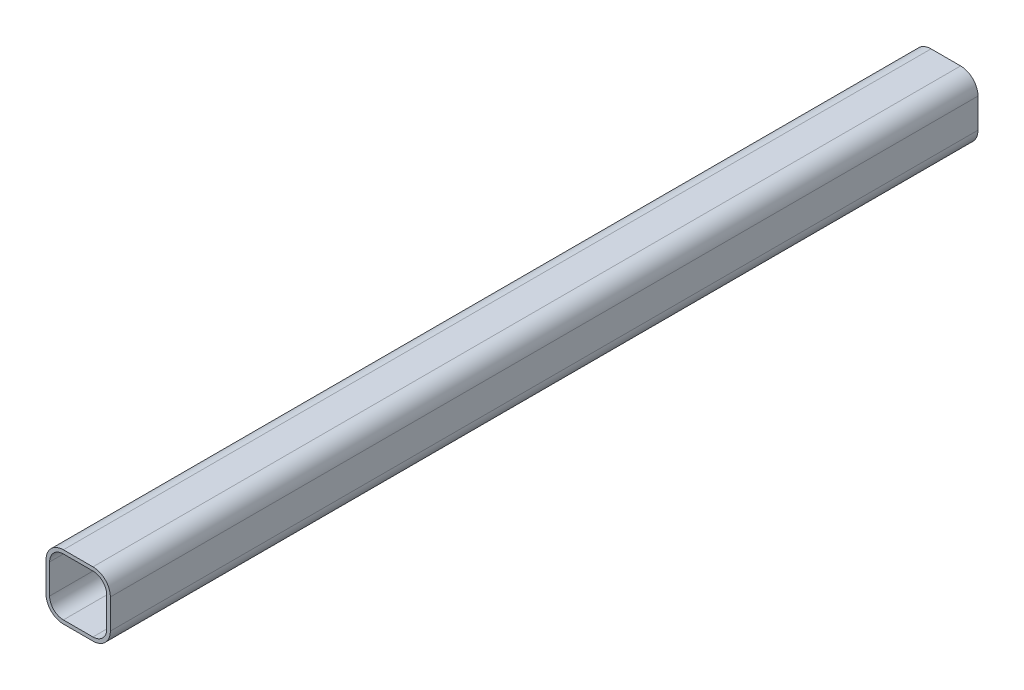
ISO-10303-21;
HEADER;
FILE_DESCRIPTION(('STEP AP214'),'2;1');
FILE_NAME('part.step','',(''),(''),'','','');
FILE_SCHEMA(('AUTOMOTIVE_DESIGN { 1 0 10303 214 1 1 1 1 }'));
ENDSEC;
DATA;
#1=APPLICATION_CONTEXT('core data for automotive mechanical design processes');
#2=APPLICATION_PROTOCOL_DEFINITION('international standard','automotive_design',2000,#1);
#3=PRODUCT_CONTEXT('',#1,'mechanical');
#4=PRODUCT('Part','Part','',(#3));
#5=PRODUCT_RELATED_PRODUCT_CATEGORY('part','',(#4));
#6=PRODUCT_DEFINITION_FORMATION('','',#4);
#7=PRODUCT_DEFINITION_CONTEXT('part definition',#1,'design');
#8=PRODUCT_DEFINITION('design','',#6,#7);
#9=PRODUCT_DEFINITION_SHAPE('','',#8);
#10=(LENGTH_UNIT() NAMED_UNIT(*) SI_UNIT(.MILLI.,.METRE.));
#11=(NAMED_UNIT(*) PLANE_ANGLE_UNIT() SI_UNIT($,.RADIAN.));
#12=(NAMED_UNIT(*) SI_UNIT($,.STERADIAN.) SOLID_ANGLE_UNIT());
#13=UNCERTAINTY_MEASURE_WITH_UNIT(LENGTH_MEASURE(1.E-05),#10,'distance_accuracy_value','');
#14=(GEOMETRIC_REPRESENTATION_CONTEXT(3) GLOBAL_UNCERTAINTY_ASSIGNED_CONTEXT((#13)) GLOBAL_UNIT_ASSIGNED_CONTEXT((#10,
#11,#12)) REPRESENTATION_CONTEXT('',''));
#15=CARTESIAN_POINT('',(0.,0.,0.));
#16=DIRECTION('',(0.,0.,1.));
#17=DIRECTION('',(1.,0.,0.));
#18=AXIS2_PLACEMENT_3D('',#15,#16,#17);
#19=CARTESIAN_POINT('',(-11.303,-11.303,-152.4));
#20=DIRECTION('',(0.,0.,1.));
#21=DIRECTION('',(1.,0.,0.));
#22=AXIS2_PLACEMENT_3D('',#19,#20,#21);
#23=PLANE('',#22);
#24=DIRECTION('',(0.,1.,0.));
#25=VECTOR('',#24,1.);
#26=CARTESIAN_POINT('',(-10.033,0.,-152.4));
#27=LINE('',#26,#25);
#28=CARTESIAN_POINT('',(-10.033,-5.19112500043521,-152.4));
#29=VERTEX_POINT('',#28);
#30=CARTESIAN_POINT('',(-10.033,5.19112499999956,-152.4));
#31=VERTEX_POINT('',#30);
#32=EDGE_CURVE('E158',#29,#31,#27,.T.);
#33=ORIENTED_EDGE('',*,*,#32,.F.);
#34=CARTESIAN_POINT('',(-5.191125,-5.19112500000087,-152.4));
#35=DIRECTION('',(0.,0.,-1.));
#36=DIRECTION('',(0.,1.,0.));
#37=AXIS2_PLACEMENT_3D('',#34,#35,#36);
#38=CIRCLE('',#37,4.841875);
#39=CARTESIAN_POINT('',(-5.19112499906869,-10.033,-152.4));
#40=VERTEX_POINT('',#39);
#41=EDGE_CURVE('E209',#40,#29,#38,.T.);
#42=ORIENTED_EDGE('',*,*,#41,.F.);
#43=DIRECTION('',(-1.,0.,0.));
#44=VECTOR('',#43,1.);
#45=CARTESIAN_POINT('',(0.,-10.033,-152.4));
#46=LINE('',#45,#44);
#47=CARTESIAN_POINT('',(5.191125,-10.033,-152.4));
#48=VERTEX_POINT('',#47);
#49=EDGE_CURVE('E154',#48,#40,#46,.T.);
#50=ORIENTED_EDGE('',*,*,#49,.F.);
#51=CARTESIAN_POINT('',(5.191125,-5.19112500000087,-152.4));
#52=DIRECTION('',(0.,0.,-1.));
#53=DIRECTION('',(0.,1.,0.));
#54=AXIS2_PLACEMENT_3D('',#51,#52,#53);
#55=CIRCLE('',#54,4.841875);
#56=CARTESIAN_POINT('',(10.033,-5.19112500099352,-152.4));
#57=VERTEX_POINT('',#56);
#58=EDGE_CURVE('E213',#57,#48,#55,.T.);
#59=ORIENTED_EDGE('',*,*,#58,.F.);
#60=DIRECTION('',(0.,-1.,0.));
#61=VECTOR('',#60,1.);
#62=CARTESIAN_POINT('',(10.033,0.,-152.4));
#63=LINE('',#62,#61);
#64=CARTESIAN_POINT('',(10.033,5.19112499999956,-152.4));
#65=VERTEX_POINT('',#64);
#66=EDGE_CURVE('E163',#65,#57,#63,.T.);
#67=ORIENTED_EDGE('',*,*,#66,.F.);
#68=CARTESIAN_POINT('',(5.191125,5.19112499999913,-152.4));
#69=DIRECTION('',(0.,0.,-1.));
#70=DIRECTION('',(0.,1.,0.));
#71=AXIS2_PLACEMENT_3D('',#68,#69,#70);
#72=CIRCLE('',#71,4.841875);
#73=CARTESIAN_POINT('',(5.19112500049654,10.033,-152.4));
#74=VERTEX_POINT('',#73);
#75=EDGE_CURVE('E216',#74,#65,#72,.T.);
#76=ORIENTED_EDGE('',*,*,#75,.F.);
#77=DIRECTION('',(1.,0.,0.));
#78=VECTOR('',#77,1.);
#79=CARTESIAN_POINT('',(0.,10.033,-152.4));
#80=LINE('',#79,#78);
#81=CARTESIAN_POINT('',(-5.191125,10.033,-152.4));
#82=VERTEX_POINT('',#81);
#83=EDGE_CURVE('E168',#82,#74,#80,.T.);
#84=ORIENTED_EDGE('',*,*,#83,.F.);
#85=CARTESIAN_POINT('',(-5.191125,5.19112499999913,-152.4));
#86=DIRECTION('',(0.,0.,-1.));
#87=DIRECTION('',(0.,1.,0.));
#88=AXIS2_PLACEMENT_3D('',#85,#86,#87);
#89=CIRCLE('',#88,4.841875);
#90=EDGE_CURVE('E161',#31,#82,#89,.T.);
#91=ORIENTED_EDGE('',*,*,#90,.F.);
#92=EDGE_LOOP('',(#33,#42,#50,#59,#67,#76,#84,#91));
#93=FACE_BOUND('',#92,.T.);
#94=DIRECTION('',(0.,-1.,0.));
#95=VECTOR('',#94,1.);
#96=CARTESIAN_POINT('',(11.303,0.,-152.4));
#97=LINE('',#96,#95);
#98=CARTESIAN_POINT('',(11.303,5.19112499999965,-152.4));
#99=VERTEX_POINT('',#98);
#100=CARTESIAN_POINT('',(11.303,-5.19112500000035,-152.4));
#101=VERTEX_POINT('',#100);
#102=EDGE_CURVE('E162',#99,#101,#97,.T.);
#103=ORIENTED_EDGE('',*,*,#102,.T.);
#104=CARTESIAN_POINT('',(5.191125,-5.19112500000069,-152.4));
#105=DIRECTION('',(0.,0.,-1.));
#106=DIRECTION('',(0.,1.,0.));
#107=AXIS2_PLACEMENT_3D('',#104,#105,#106);
#108=CIRCLE('',#107,6.111875);
#109=CARTESIAN_POINT('',(5.19112500117559,-11.303,-152.4));
#110=VERTEX_POINT('',#109);
#111=EDGE_CURVE('E221',#101,#110,#108,.T.);
#112=ORIENTED_EDGE('',*,*,#111,.T.);
#113=DIRECTION('',(-1.,0.,0.));
#114=VECTOR('',#113,1.);
#115=CARTESIAN_POINT('',(0.,-11.303,-152.4));
#116=LINE('',#115,#114);
#117=CARTESIAN_POINT('',(-5.191125,-11.303,-152.4));
#118=VERTEX_POINT('',#117);
#119=EDGE_CURVE('E174',#110,#118,#116,.T.);
#120=ORIENTED_EDGE('',*,*,#119,.T.);
#121=CARTESIAN_POINT('',(-5.191125,-5.19112500000069,-152.4));
#122=DIRECTION('',(0.,0.,-1.));
#123=DIRECTION('',(0.,1.,0.));
#124=AXIS2_PLACEMENT_3D('',#121,#122,#123);
#125=CIRCLE('',#124,6.111875);
#126=CARTESIAN_POINT('',(-11.303,-5.19112500054915,-152.4));
#127=VERTEX_POINT('',#126);
#128=EDGE_CURVE('E225',#118,#127,#125,.T.);
#129=ORIENTED_EDGE('',*,*,#128,.T.);
#130=DIRECTION('',(0.,1.,0.));
#131=VECTOR('',#130,1.);
#132=CARTESIAN_POINT('',(-11.303,0.,-152.4));
#133=LINE('',#132,#131);
#134=CARTESIAN_POINT('',(-11.303,5.19112499999965,-152.4));
#135=VERTEX_POINT('',#134);
#136=EDGE_CURVE('E179',#127,#135,#133,.T.);
#137=ORIENTED_EDGE('',*,*,#136,.T.);
#138=CARTESIAN_POINT('',(-5.191125,5.19112499999931,-152.4));
#139=DIRECTION('',(0.,0.,-1.));
#140=DIRECTION('',(0.,1.,0.));
#141=AXIS2_PLACEMENT_3D('',#138,#139,#140);
#142=CIRCLE('',#141,6.111875);
#143=CARTESIAN_POINT('',(-5.19112499937322,11.303,-152.4));
#144=VERTEX_POINT('',#143);
#145=EDGE_CURVE('E141',#135,#144,#142,.T.);
#146=ORIENTED_EDGE('',*,*,#145,.T.);
#147=DIRECTION('',(1.,0.,0.));
#148=VECTOR('',#147,1.);
#149=CARTESIAN_POINT('',(0.,11.303,-152.4));
#150=LINE('',#149,#148);
#151=CARTESIAN_POINT('',(5.191125,11.303,-152.4));
#152=VERTEX_POINT('',#151);
#153=EDGE_CURVE('E139',#144,#152,#150,.T.);
#154=ORIENTED_EDGE('',*,*,#153,.T.);
#155=CARTESIAN_POINT('',(5.191125,5.19112499999931,-152.4));
#156=DIRECTION('',(0.,0.,-1.));
#157=DIRECTION('',(0.,1.,0.));
#158=AXIS2_PLACEMENT_3D('',#155,#156,#157);
#159=CIRCLE('',#158,6.111875);
#160=EDGE_CURVE('E20',#152,#99,#159,.T.);
#161=ORIENTED_EDGE('',*,*,#160,.T.);
#162=EDGE_LOOP('',(#103,#112,#120,#129,#137,#146,#154,#161));
#163=FACE_BOUND('',#162,.T.);
#164=ADVANCED_FACE('F16',(#93,#163),#23,.F.);
#165=CARTESIAN_POINT('',(5.191125,5.191125,152.4));
#166=DIRECTION('',(0.,0.,-1.));
#167=DIRECTION('',(0.,1.,0.));
#168=AXIS2_PLACEMENT_3D('',#165,#166,#167);
#169=CYLINDRICAL_SURFACE('',#168,6.111875);
#170=DIRECTION('',(0.,0.,1.));
#171=VECTOR('',#170,1.);
#172=CARTESIAN_POINT('',(5.191125,11.303,0.));
#173=LINE('',#172,#171);
#174=CARTESIAN_POINT('',(5.191125,11.303,152.4));
#175=VERTEX_POINT('',#174);
#176=EDGE_CURVE('E131',#152,#175,#173,.T.);
#177=ORIENTED_EDGE('',*,*,#176,.T.);
#178=CARTESIAN_POINT('',(5.191125,5.191125,152.4));
#179=DIRECTION('',(0.,0.,-1.));
#180=DIRECTION('',(0.,1.,0.));
#181=AXIS2_PLACEMENT_3D('',#178,#179,#180);
#182=CIRCLE('',#181,6.111875);
#183=CARTESIAN_POINT('',(11.303,5.191125,152.4));
#184=VERTEX_POINT('',#183);
#185=EDGE_CURVE('E207',#184,#175,#182,.F.);
#186=ORIENTED_EDGE('',*,*,#185,.F.);
#187=DIRECTION('',(0.,0.,-1.));
#188=VECTOR('',#187,1.);
#189=CARTESIAN_POINT('',(11.303,5.191125,0.));
#190=LINE('',#189,#188);
#191=EDGE_CURVE('E134',#184,#99,#190,.T.);
#192=ORIENTED_EDGE('',*,*,#191,.T.);
#193=ORIENTED_EDGE('',*,*,#160,.F.);
#194=EDGE_LOOP('',(#177,#186,#192,#193));
#195=FACE_BOUND('',#194,.T.);
#196=ADVANCED_FACE('F129',(#195),#169,.T.);
#197=CARTESIAN_POINT('',(-5.191125,11.303,152.4));
#198=DIRECTION('',(0.,-1.,0.));
#199=DIRECTION('',(0.,0.,-1.));
#200=AXIS2_PLACEMENT_3D('',#197,#198,#199);
#201=PLANE('',#200);
#202=DIRECTION('',(0.,0.,-1.));
#203=VECTOR('',#202,1.);
#204=CARTESIAN_POINT('',(-5.19112499874643,11.303,0.));
#205=LINE('',#204,#203);
#206=CARTESIAN_POINT('',(-5.19112499937322,11.303,152.4));
#207=VERTEX_POINT('',#206);
#208=EDGE_CURVE('E144',#144,#207,#205,.F.);
#209=ORIENTED_EDGE('',*,*,#208,.T.);
#210=DIRECTION('',(-1.,0.,0.));
#211=VECTOR('',#210,1.);
#212=CARTESIAN_POINT('',(0.,11.303,152.4));
#213=LINE('',#212,#211);
#214=EDGE_CURVE('E148',#175,#207,#213,.T.);
#215=ORIENTED_EDGE('',*,*,#214,.F.);
#216=ORIENTED_EDGE('',*,*,#176,.F.);
#217=ORIENTED_EDGE('',*,*,#153,.F.);
#218=EDGE_LOOP('',(#209,#215,#216,#217));
#219=FACE_BOUND('',#218,.T.);
#220=ADVANCED_FACE('F146',(#219),#201,.F.);
#221=CARTESIAN_POINT('',(-5.191125,5.191125,152.4));
#222=DIRECTION('',(0.,0.,-1.));
#223=DIRECTION('',(0.,1.,0.));
#224=AXIS2_PLACEMENT_3D('',#221,#222,#223);
#225=CYLINDRICAL_SURFACE('',#224,6.111875);
#226=DIRECTION('',(0.,0.,1.));
#227=VECTOR('',#226,1.);
#228=CARTESIAN_POINT('',(-11.303,5.191125,0.));
#229=LINE('',#228,#227);
#230=CARTESIAN_POINT('',(-11.303,5.191125,152.4));
#231=VERTEX_POINT('',#230);
#232=EDGE_CURVE('E181',#135,#231,#229,.T.);
#233=ORIENTED_EDGE('',*,*,#232,.T.);
#234=CARTESIAN_POINT('',(-5.191125,5.191125,152.4));
#235=DIRECTION('',(0.,0.,-1.));
#236=DIRECTION('',(0.,1.,0.));
#237=AXIS2_PLACEMENT_3D('',#234,#235,#236);
#238=CIRCLE('',#237,6.111875);
#239=EDGE_CURVE('E204',#207,#231,#238,.F.);
#240=ORIENTED_EDGE('',*,*,#239,.F.);
#241=ORIENTED_EDGE('',*,*,#208,.F.);
#242=ORIENTED_EDGE('',*,*,#145,.F.);
#243=EDGE_LOOP('',(#233,#240,#241,#242));
#244=FACE_BOUND('',#243,.T.);
#245=ADVANCED_FACE('F229',(#244),#225,.T.);
#246=CARTESIAN_POINT('',(-11.303,-5.191125,152.4));
#247=DIRECTION('',(1.,0.,0.));
#248=DIRECTION('',(0.,0.,-1.));
#249=AXIS2_PLACEMENT_3D('',#246,#247,#248);
#250=PLANE('',#249);
#251=DIRECTION('',(0.,0.,-1.));
#252=VECTOR('',#251,1.);
#253=CARTESIAN_POINT('',(-11.303,-5.19112500109762,0.));
#254=LINE('',#253,#252);
#255=CARTESIAN_POINT('',(-11.303,-5.19112500054881,152.4));
#256=VERTEX_POINT('',#255);
#257=EDGE_CURVE('E180',#127,#256,#254,.F.);
#258=ORIENTED_EDGE('',*,*,#257,.T.);
#259=DIRECTION('',(0.,-1.,0.));
#260=VECTOR('',#259,1.);
#261=CARTESIAN_POINT('',(-11.303,0.,152.4));
#262=LINE('',#261,#260);
#263=EDGE_CURVE('E203',#231,#256,#262,.T.);
#264=ORIENTED_EDGE('',*,*,#263,.F.);
#265=ORIENTED_EDGE('',*,*,#232,.F.);
#266=ORIENTED_EDGE('',*,*,#136,.F.);
#267=EDGE_LOOP('',(#258,#264,#265,#266));
#268=FACE_BOUND('',#267,.T.);
#269=ADVANCED_FACE('F261',(#268),#250,.F.);
#270=CARTESIAN_POINT('',(-5.191125,-5.191125,152.4));
#271=DIRECTION('',(0.,0.,-1.));
#272=DIRECTION('',(0.,1.,0.));
#273=AXIS2_PLACEMENT_3D('',#270,#271,#272);
#274=CYLINDRICAL_SURFACE('',#273,6.111875);
#275=DIRECTION('',(0.,0.,1.));
#276=VECTOR('',#275,1.);
#277=CARTESIAN_POINT('',(-5.191125,-11.303,0.));
#278=LINE('',#277,#276);
#279=CARTESIAN_POINT('',(-5.191125,-11.303,152.4));
#280=VERTEX_POINT('',#279);
#281=EDGE_CURVE('E178',#118,#280,#278,.T.);
#282=ORIENTED_EDGE('',*,*,#281,.T.);
#283=CARTESIAN_POINT('',(-5.191125,-5.191125,152.4));
#284=DIRECTION('',(0.,0.,-1.));
#285=DIRECTION('',(0.,1.,0.));
#286=AXIS2_PLACEMENT_3D('',#283,#284,#285);
#287=CIRCLE('',#286,6.111875);
#288=EDGE_CURVE('E200',#256,#280,#287,.F.);
#289=ORIENTED_EDGE('',*,*,#288,.F.);
#290=ORIENTED_EDGE('',*,*,#257,.F.);
#291=ORIENTED_EDGE('',*,*,#128,.F.);
#292=EDGE_LOOP('',(#282,#289,#290,#291));
#293=FACE_BOUND('',#292,.T.);
#294=ADVANCED_FACE('F263',(#293),#274,.T.);
#295=CARTESIAN_POINT('',(-5.191125,-11.303,-152.4));
#296=DIRECTION('',(0.,1.,0.));
#297=DIRECTION('',(0.,0.,1.));
#298=AXIS2_PLACEMENT_3D('',#295,#296,#297);
#299=PLANE('',#298);
#300=DIRECTION('',(0.,0.,-1.));
#301=VECTOR('',#300,1.);
#302=CARTESIAN_POINT('',(5.19112500235118,-11.303,0.));
#303=LINE('',#302,#301);
#304=CARTESIAN_POINT('',(5.19112500117559,-11.303,152.4));
#305=VERTEX_POINT('',#304);
#306=EDGE_CURVE('E177',#110,#305,#303,.F.);
#307=ORIENTED_EDGE('',*,*,#306,.T.);
#308=DIRECTION('',(1.,0.,0.));
#309=VECTOR('',#308,1.);
#310=CARTESIAN_POINT('',(0.,-11.303,152.4));
#311=LINE('',#310,#309);
#312=EDGE_CURVE('E199',#280,#305,#311,.T.);
#313=ORIENTED_EDGE('',*,*,#312,.F.);
#314=ORIENTED_EDGE('',*,*,#281,.F.);
#315=ORIENTED_EDGE('',*,*,#119,.F.);
#316=EDGE_LOOP('',(#307,#313,#314,#315));
#317=FACE_BOUND('',#316,.T.);
#318=ADVANCED_FACE('F319',(#317),#299,.F.);
#319=CARTESIAN_POINT('',(5.191125,-5.191125,152.4));
#320=DIRECTION('',(0.,0.,-1.));
#321=DIRECTION('',(0.,1.,0.));
#322=AXIS2_PLACEMENT_3D('',#319,#320,#321);
#323=CYLINDRICAL_SURFACE('',#322,6.111875);
#324=DIRECTION('',(0.,0.,1.));
#325=VECTOR('',#324,1.);
#326=CARTESIAN_POINT('',(11.303,-5.191125,0.));
#327=LINE('',#326,#325);
#328=CARTESIAN_POINT('',(11.303,-5.191125,152.4));
#329=VERTEX_POINT('',#328);
#330=EDGE_CURVE('E224',#101,#329,#327,.T.);
#331=ORIENTED_EDGE('',*,*,#330,.T.);
#332=CARTESIAN_POINT('',(5.191125,-5.191125,152.4));
#333=DIRECTION('',(0.,0.,-1.));
#334=DIRECTION('',(0.,1.,0.));
#335=AXIS2_PLACEMENT_3D('',#332,#333,#334);
#336=CIRCLE('',#335,6.111875);
#337=EDGE_CURVE('E195',#305,#329,#336,.F.);
#338=ORIENTED_EDGE('',*,*,#337,.F.);
#339=ORIENTED_EDGE('',*,*,#306,.F.);
#340=ORIENTED_EDGE('',*,*,#111,.F.);
#341=EDGE_LOOP('',(#331,#338,#339,#340));
#342=FACE_BOUND('',#341,.T.);
#343=ADVANCED_FACE('F315',(#342),#323,.T.);
#344=CARTESIAN_POINT('',(11.303,-5.191125,-152.4));
#345=DIRECTION('',(-1.,0.,0.));
#346=DIRECTION('',(0.,0.,1.));
#347=AXIS2_PLACEMENT_3D('',#344,#345,#346);
#348=PLANE('',#347);
#349=ORIENTED_EDGE('',*,*,#191,.F.);
#350=DIRECTION('',(0.,1.,0.));
#351=VECTOR('',#350,1.);
#352=CARTESIAN_POINT('',(11.303,0.,152.4));
#353=LINE('',#352,#351);
#354=EDGE_CURVE('E198',#329,#184,#353,.T.);
#355=ORIENTED_EDGE('',*,*,#354,.F.);
#356=ORIENTED_EDGE('',*,*,#330,.F.);
#357=ORIENTED_EDGE('',*,*,#102,.F.);
#358=EDGE_LOOP('',(#349,#355,#356,#357));
#359=FACE_BOUND('',#358,.T.);
#360=ADVANCED_FACE('F318',(#359),#348,.F.);
#361=CARTESIAN_POINT('',(-10.033,-5.191125,152.4));
#362=DIRECTION('',(1.,0.,0.));
#363=DIRECTION('',(0.,0.,-1.));
#364=AXIS2_PLACEMENT_3D('',#361,#362,#363);
#365=PLANE('',#364);
#366=DIRECTION('',(0.,1.,0.));
#367=VECTOR('',#366,1.);
#368=CARTESIAN_POINT('',(-10.03300000635,0.,152.4));
#369=LINE('',#368,#367);
#370=CARTESIAN_POINT('',(-10.033000003175,-5.19112500043477,152.4));
#371=VERTEX_POINT('',#370);
#372=CARTESIAN_POINT('',(-10.033000003175,5.191125,152.4));
#373=VERTEX_POINT('',#372);
#374=EDGE_CURVE('E194',#371,#373,#369,.T.);
#375=ORIENTED_EDGE('',*,*,#374,.F.);
#376=DIRECTION('',(0.,0.,-1.));
#377=VECTOR('',#376,1.);
#378=CARTESIAN_POINT('',(-10.033,-5.19112500086954,0.));
#379=LINE('',#378,#377);
#380=EDGE_CURVE('E212',#29,#371,#379,.F.);
#381=ORIENTED_EDGE('',*,*,#380,.F.);
#382=ORIENTED_EDGE('',*,*,#32,.T.);
#383=DIRECTION('',(0.,0.,1.));
#384=VECTOR('',#383,1.);
#385=CARTESIAN_POINT('',(-10.033,5.191125,0.));
#386=LINE('',#385,#384);
#387=EDGE_CURVE('E172',#373,#31,#386,.F.);
#388=ORIENTED_EDGE('',*,*,#387,.F.);
#389=EDGE_LOOP('',(#375,#381,#382,#388));
#390=FACE_BOUND('',#389,.T.);
#391=ADVANCED_FACE('F298',(#390),#365,.T.);
#392=CARTESIAN_POINT('',(-5.191125,5.191125,152.4));
#393=DIRECTION('',(0.,0.,-1.));
#394=DIRECTION('',(0.,1.,0.));
#395=AXIS2_PLACEMENT_3D('',#392,#393,#394);
#396=CYLINDRICAL_SURFACE('',#395,4.841875);
#397=CARTESIAN_POINT('',(-5.191125,5.191125,152.4));
#398=DIRECTION('',(0.,0.,-1.));
#399=DIRECTION('',(0.,1.,0.));
#400=AXIS2_PLACEMENT_3D('',#397,#398,#399);
#401=CIRCLE('',#400,4.841875);
#402=CARTESIAN_POINT('',(-5.191125,10.033000003175,152.4));
#403=VERTEX_POINT('',#402);
#404=EDGE_CURVE('E191',#373,#403,#401,.T.);
#405=ORIENTED_EDGE('',*,*,#404,.F.);
#406=ORIENTED_EDGE('',*,*,#387,.T.);
#407=ORIENTED_EDGE('',*,*,#90,.T.);
#408=DIRECTION('',(0.,0.,-1.));
#409=VECTOR('',#408,1.);
#410=CARTESIAN_POINT('',(-5.191125,10.033,0.));
#411=LINE('',#410,#409);
#412=EDGE_CURVE('E171',#403,#82,#411,.T.);
#413=ORIENTED_EDGE('',*,*,#412,.F.);
#414=EDGE_LOOP('',(#405,#406,#407,#413));
#415=FACE_BOUND('',#414,.T.);
#416=ADVANCED_FACE('F295',(#415),#396,.F.);
#417=CARTESIAN_POINT('',(-5.191125,10.033,152.4));
#418=DIRECTION('',(0.,-1.,0.));
#419=DIRECTION('',(0.,0.,-1.));
#420=AXIS2_PLACEMENT_3D('',#417,#418,#419);
#421=PLANE('',#420);
#422=DIRECTION('',(1.,0.,0.));
#423=VECTOR('',#422,1.);
#424=CARTESIAN_POINT('',(0.,10.03300000635,152.4));
#425=LINE('',#424,#423);
#426=CARTESIAN_POINT('',(5.19112500049654,10.033000003175,152.4));
#427=VERTEX_POINT('',#426);
#428=EDGE_CURVE('E190',#403,#427,#425,.T.);
#429=ORIENTED_EDGE('',*,*,#428,.F.);
#430=ORIENTED_EDGE('',*,*,#412,.T.);
#431=ORIENTED_EDGE('',*,*,#83,.T.);
#432=DIRECTION('',(0.,0.,1.));
#433=VECTOR('',#432,1.);
#434=CARTESIAN_POINT('',(5.19112500099309,10.033,0.));
#435=LINE('',#434,#433);
#436=EDGE_CURVE('E167',#427,#74,#435,.F.);
#437=ORIENTED_EDGE('',*,*,#436,.F.);
#438=EDGE_LOOP('',(#429,#430,#431,#437));
#439=FACE_BOUND('',#438,.T.);
#440=ADVANCED_FACE('F292',(#439),#421,.T.);
#441=CARTESIAN_POINT('',(5.191125,5.191125,152.4));
#442=DIRECTION('',(0.,0.,-1.));
#443=DIRECTION('',(0.,1.,0.));
#444=AXIS2_PLACEMENT_3D('',#441,#442,#443);
#445=CYLINDRICAL_SURFACE('',#444,4.841875);
#446=CARTESIAN_POINT('',(5.191125,5.191125,152.4));
#447=DIRECTION('',(0.,0.,-1.));
#448=DIRECTION('',(0.,1.,0.));
#449=AXIS2_PLACEMENT_3D('',#446,#447,#448);
#450=CIRCLE('',#449,4.841875);
#451=CARTESIAN_POINT('',(10.033000003175,5.191125,152.4));
#452=VERTEX_POINT('',#451);
#453=EDGE_CURVE('E187',#427,#452,#450,.T.);
#454=ORIENTED_EDGE('',*,*,#453,.F.);
#455=ORIENTED_EDGE('',*,*,#436,.T.);
#456=ORIENTED_EDGE('',*,*,#75,.T.);
#457=DIRECTION('',(0.,0.,-1.));
#458=VECTOR('',#457,1.);
#459=CARTESIAN_POINT('',(10.033,5.191125,0.));
#460=LINE('',#459,#458);
#461=EDGE_CURVE('E166',#452,#65,#460,.T.);
#462=ORIENTED_EDGE('',*,*,#461,.F.);
#463=EDGE_LOOP('',(#454,#455,#456,#462));
#464=FACE_BOUND('',#463,.T.);
#465=ADVANCED_FACE('F289',(#464),#445,.F.);
#466=CARTESIAN_POINT('',(10.033,-5.191125,-152.4));
#467=DIRECTION('',(-1.,0.,0.));
#468=DIRECTION('',(0.,0.,1.));
#469=AXIS2_PLACEMENT_3D('',#466,#467,#468);
#470=PLANE('',#469);
#471=DIRECTION('',(0.,-1.,0.));
#472=VECTOR('',#471,1.);
#473=CARTESIAN_POINT('',(10.03300000635,0.,152.4));
#474=LINE('',#473,#472);
#475=CARTESIAN_POINT('',(10.033000003175,-5.19112500099309,152.4));
#476=VERTEX_POINT('',#475);
#477=EDGE_CURVE('E186',#452,#476,#474,.T.);
#478=ORIENTED_EDGE('',*,*,#477,.F.);
#479=ORIENTED_EDGE('',*,*,#461,.T.);
#480=ORIENTED_EDGE('',*,*,#66,.T.);
#481=DIRECTION('',(0.,0.,1.));
#482=VECTOR('',#481,1.);
#483=CARTESIAN_POINT('',(10.033,-5.19112500198617,0.));
#484=LINE('',#483,#482);
#485=EDGE_CURVE('E157',#476,#57,#484,.F.);
#486=ORIENTED_EDGE('',*,*,#485,.F.);
#487=EDGE_LOOP('',(#478,#479,#480,#486));
#488=FACE_BOUND('',#487,.T.);
#489=ADVANCED_FACE('F286',(#488),#470,.T.);
#490=CARTESIAN_POINT('',(5.191125,-5.191125,152.4));
#491=DIRECTION('',(0.,0.,-1.));
#492=DIRECTION('',(0.,1.,0.));
#493=AXIS2_PLACEMENT_3D('',#490,#491,#492);
#494=CYLINDRICAL_SURFACE('',#493,4.841875);
#495=CARTESIAN_POINT('',(5.191125,-5.191125,152.4));
#496=DIRECTION('',(0.,0.,-1.));
#497=DIRECTION('',(0.,1.,0.));
#498=AXIS2_PLACEMENT_3D('',#495,#496,#497);
#499=CIRCLE('',#498,4.841875);
#500=CARTESIAN_POINT('',(5.191125,-10.033000003175,152.4));
#501=VERTEX_POINT('',#500);
#502=EDGE_CURVE('E183',#476,#501,#499,.T.);
#503=ORIENTED_EDGE('',*,*,#502,.F.);
#504=ORIENTED_EDGE('',*,*,#485,.T.);
#505=ORIENTED_EDGE('',*,*,#58,.T.);
#506=DIRECTION('',(0.,0.,-1.));
#507=VECTOR('',#506,1.);
#508=CARTESIAN_POINT('',(5.191125,-10.033,0.));
#509=LINE('',#508,#507);
#510=EDGE_CURVE('E156',#501,#48,#509,.T.);
#511=ORIENTED_EDGE('',*,*,#510,.F.);
#512=EDGE_LOOP('',(#503,#504,#505,#511));
#513=FACE_BOUND('',#512,.T.);
#514=ADVANCED_FACE('F282',(#513),#494,.F.);
#515=CARTESIAN_POINT('',(-5.191125,-10.033,-152.4));
#516=DIRECTION('',(0.,1.,0.));
#517=DIRECTION('',(0.,0.,1.));
#518=AXIS2_PLACEMENT_3D('',#515,#516,#517);
#519=PLANE('',#518);
#520=DIRECTION('',(-1.,0.,0.));
#521=VECTOR('',#520,1.);
#522=CARTESIAN_POINT('',(0.,-10.03300000635,152.4));
#523=LINE('',#522,#521);
#524=CARTESIAN_POINT('',(-5.19112499906869,-10.033000003175,152.4));
#525=VERTEX_POINT('',#524);
#526=EDGE_CURVE('E26',#501,#525,#523,.T.);
#527=ORIENTED_EDGE('',*,*,#526,.F.);
#528=ORIENTED_EDGE('',*,*,#510,.T.);
#529=ORIENTED_EDGE('',*,*,#49,.T.);
#530=DIRECTION('',(0.,0.,1.));
#531=VECTOR('',#530,1.);
#532=CARTESIAN_POINT('',(-5.19112499813738,-10.033,0.));
#533=LINE('',#532,#531);
#534=EDGE_CURVE('E35',#525,#40,#533,.F.);
#535=ORIENTED_EDGE('',*,*,#534,.F.);
#536=EDGE_LOOP('',(#527,#528,#529,#535));
#537=FACE_BOUND('',#536,.T.);
#538=ADVANCED_FACE('F280',(#537),#519,.T.);
#539=CARTESIAN_POINT('',(-5.191125,-5.191125,152.4));
#540=DIRECTION('',(0.,0.,-1.));
#541=DIRECTION('',(0.,1.,0.));
#542=AXIS2_PLACEMENT_3D('',#539,#540,#541);
#543=CYLINDRICAL_SURFACE('',#542,4.841875);
#544=CARTESIAN_POINT('',(-5.191125,-5.191125,152.4));
#545=DIRECTION('',(0.,0.,-1.));
#546=DIRECTION('',(0.,1.,0.));
#547=AXIS2_PLACEMENT_3D('',#544,#545,#546);
#548=CIRCLE('',#547,4.841875);
#549=EDGE_CURVE('E10',#525,#371,#548,.T.);
#550=ORIENTED_EDGE('',*,*,#549,.F.);
#551=ORIENTED_EDGE('',*,*,#534,.T.);
#552=ORIENTED_EDGE('',*,*,#41,.T.);
#553=ORIENTED_EDGE('',*,*,#380,.T.);
#554=EDGE_LOOP('',(#550,#551,#552,#553));
#555=FACE_BOUND('',#554,.T.);
#556=ADVANCED_FACE('F300',(#555),#543,.F.);
#557=CARTESIAN_POINT('',(-11.303,-11.303,152.4));
#558=DIRECTION('',(0.,0.,1.));
#559=DIRECTION('',(1.,0.,0.));
#560=AXIS2_PLACEMENT_3D('',#557,#558,#559);
#561=PLANE('',#560);
#562=ORIENTED_EDGE('',*,*,#526,.T.);
#563=ORIENTED_EDGE('',*,*,#549,.T.);
#564=ORIENTED_EDGE('',*,*,#374,.T.);
#565=ORIENTED_EDGE('',*,*,#404,.T.);
#566=ORIENTED_EDGE('',*,*,#428,.T.);
#567=ORIENTED_EDGE('',*,*,#453,.T.);
#568=ORIENTED_EDGE('',*,*,#477,.T.);
#569=ORIENTED_EDGE('',*,*,#502,.T.);
#570=EDGE_LOOP('',(#562,#563,#564,#565,#566,#567,#568,#569));
#571=FACE_BOUND('',#570,.T.);
#572=ORIENTED_EDGE('',*,*,#337,.T.);
#573=ORIENTED_EDGE('',*,*,#354,.T.);
#574=ORIENTED_EDGE('',*,*,#185,.T.);
#575=ORIENTED_EDGE('',*,*,#214,.T.);
#576=ORIENTED_EDGE('',*,*,#239,.T.);
#577=ORIENTED_EDGE('',*,*,#263,.T.);
#578=ORIENTED_EDGE('',*,*,#288,.T.);
#579=ORIENTED_EDGE('',*,*,#312,.T.);
#580=EDGE_LOOP('',(#572,#573,#574,#575,#576,#577,#578,#579));
#581=FACE_BOUND('',#580,.T.);
#582=ADVANCED_FACE('F18',(#571,#581),#561,.T.);
#583=CLOSED_SHELL('',(#164,#196,#220,#245,#269,#294,#318,#343,#360,#391,#416,#440,#465,#489,
#514,#538,#556,#582));
#584=MANIFOLD_SOLID_BREP('B1',#583);
#585=ADVANCED_BREP_SHAPE_REPRESENTATION('',(#18,#584),#14);
#586=SHAPE_DEFINITION_REPRESENTATION(#9,#585);
ENDSEC;
END-ISO-10303-21;
